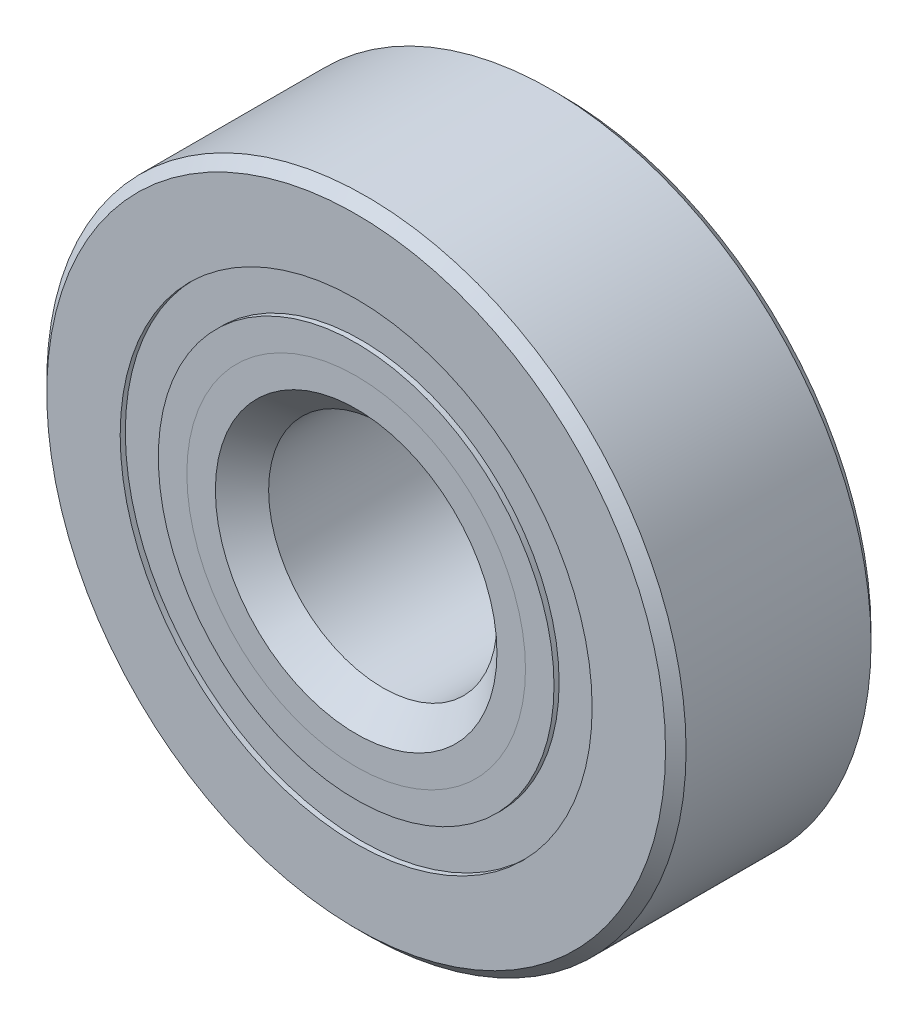
ISO-10303-21;
HEADER;
FILE_DESCRIPTION(('STEP AP214'),'2;1');
FILE_NAME('part.step','',(''),(''),'','','');
FILE_SCHEMA(('AUTOMOTIVE_DESIGN { 1 0 10303 214 1 1 1 1 }'));
ENDSEC;
DATA;
#1=APPLICATION_CONTEXT('core data for automotive mechanical design processes');
#2=APPLICATION_PROTOCOL_DEFINITION('international standard','automotive_design',2000,#1);
#3=PRODUCT_CONTEXT('',#1,'mechanical');
#4=PRODUCT('Part','Part','',(#3));
#5=PRODUCT_RELATED_PRODUCT_CATEGORY('part','',(#4));
#6=PRODUCT_DEFINITION_FORMATION('','',#4);
#7=PRODUCT_DEFINITION_CONTEXT('part definition',#1,'design');
#8=PRODUCT_DEFINITION('design','',#6,#7);
#9=PRODUCT_DEFINITION_SHAPE('','',#8);
#10=(LENGTH_UNIT() NAMED_UNIT(*) SI_UNIT(.MILLI.,.METRE.));
#11=(NAMED_UNIT(*) PLANE_ANGLE_UNIT() SI_UNIT($,.RADIAN.));
#12=(NAMED_UNIT(*) SI_UNIT($,.STERADIAN.) SOLID_ANGLE_UNIT());
#13=UNCERTAINTY_MEASURE_WITH_UNIT(LENGTH_MEASURE(1.E-05),#10,'distance_accuracy_value','');
#14=(GEOMETRIC_REPRESENTATION_CONTEXT(3) GLOBAL_UNCERTAINTY_ASSIGNED_CONTEXT((#13)) GLOBAL_UNIT_ASSIGNED_CONTEXT((#10,
#11,#12)) REPRESENTATION_CONTEXT('',''));
#15=CARTESIAN_POINT('',(0.,0.,0.));
#16=DIRECTION('',(0.,0.,1.));
#17=DIRECTION('',(1.,0.,0.));
#18=AXIS2_PLACEMENT_3D('',#15,#16,#17);
#19=CARTESIAN_POINT('',(0.,8.20353708791209,-3.39328125));
#20=DIRECTION('',(0.,0.,1.));
#21=DIRECTION('',(1.,0.,0.));
#22=AXIS2_PLACEMENT_3D('',#19,#20,#21);
#23=PLANE('',#22);
#24=CARTESIAN_POINT('',(0.,0.,-3.39328125));
#25=DIRECTION('',(0.,0.,1.));
#26=DIRECTION('',(1.,0.,0.));
#27=AXIS2_PLACEMENT_3D('',#24,#25,#26);
#28=CIRCLE('',#27,8.20353708791209);
#29=CARTESIAN_POINT('',(8.20353708791209,0.,-3.39328125));
#30=VERTEX_POINT('',#29);
#31=EDGE_CURVE('E57',#30,#30,#28,.T.);
#32=ORIENTED_EDGE('',*,*,#31,.F.);
#33=EDGE_LOOP('',(#32));
#34=FACE_BOUND('',#33,.T.);
#35=CARTESIAN_POINT('',(0.,0.,-3.39328125));
#36=DIRECTION('',(0.,0.,1.));
#37=DIRECTION('',(1.,0.,0.));
#38=AXIS2_PLACEMENT_3D('',#35,#36,#37);
#39=CIRCLE('',#38,6.87771291208791);
#40=CARTESIAN_POINT('',(6.87771291208791,0.,-3.39328125));
#41=VERTEX_POINT('',#40);
#42=EDGE_CURVE('E11',#41,#41,#39,.T.);
#43=ORIENTED_EDGE('',*,*,#42,.T.);
#44=EDGE_LOOP('',(#43));
#45=FACE_BOUND('',#44,.T.);
#46=ADVANCED_FACE('F43',(#34,#45),#23,.F.);
#47=CARTESIAN_POINT('',(0.,0.,3.571875));
#48=DIRECTION('',(0.,0.,1.));
#49=DIRECTION('',(1.,0.,0.));
#50=AXIS2_PLACEMENT_3D('',#47,#48,#49);
#51=CYLINDRICAL_SURFACE('',#50,6.87771291208791);
#52=ORIENTED_EDGE('',*,*,#42,.F.);
#53=EDGE_LOOP('',(#52));
#54=FACE_BOUND('',#53,.T.);
#55=CARTESIAN_POINT('',(0.,0.,-1.72035132641561));
#56=DIRECTION('',(0.,0.,1.));
#57=DIRECTION('',(1.,0.,0.));
#58=AXIS2_PLACEMENT_3D('',#55,#56,#57);
#59=CIRCLE('',#58,6.87771291208791);
#60=CARTESIAN_POINT('',(6.87771291208791,0.,-1.72035132641561));
#61=VERTEX_POINT('',#60);
#62=EDGE_CURVE('E49',#61,#61,#59,.T.);
#63=ORIENTED_EDGE('',*,*,#62,.T.);
#64=EDGE_LOOP('',(#63));
#65=FACE_BOUND('',#64,.T.);
#66=ADVANCED_FACE('F66',(#54,#65),#51,.F.);
#67=CARTESIAN_POINT('',(0.,8.20353708791209,-1.72035132641561));
#68=DIRECTION('',(0.,0.,-1.));
#69=DIRECTION('',(-1.,0.,0.));
#70=AXIS2_PLACEMENT_3D('',#67,#68,#69);
#71=PLANE('',#70);
#72=ORIENTED_EDGE('',*,*,#62,.F.);
#73=EDGE_LOOP('',(#72));
#74=FACE_BOUND('',#73,.T.);
#75=CARTESIAN_POINT('',(0.,0.,-1.72035132641561));
#76=DIRECTION('',(0.,0.,1.));
#77=DIRECTION('',(1.,0.,0.));
#78=AXIS2_PLACEMENT_3D('',#75,#76,#77);
#79=CIRCLE('',#78,8.20353708791209);
#80=CARTESIAN_POINT('',(8.20353708791209,0.,-1.72035132641561));
#81=VERTEX_POINT('',#80);
#82=EDGE_CURVE('E53',#81,#81,#79,.T.);
#83=ORIENTED_EDGE('',*,*,#82,.T.);
#84=EDGE_LOOP('',(#83));
#85=FACE_BOUND('',#84,.T.);
#86=ADVANCED_FACE('F70',(#74,#85),#71,.F.);
#87=CARTESIAN_POINT('',(0.,0.,3.571875));
#88=DIRECTION('',(0.,0.,1.));
#89=DIRECTION('',(1.,0.,0.));
#90=AXIS2_PLACEMENT_3D('',#87,#88,#89);
#91=CYLINDRICAL_SURFACE('',#90,8.20353708791209);
#92=ORIENTED_EDGE('',*,*,#82,.F.);
#93=EDGE_LOOP('',(#92));
#94=FACE_BOUND('',#93,.T.);
#95=ORIENTED_EDGE('',*,*,#31,.T.);
#96=EDGE_LOOP('',(#95));
#97=FACE_BOUND('',#96,.T.);
#98=ADVANCED_FACE('F63',(#94,#97),#91,.T.);
#99=CLOSED_SHELL('',(#46,#66,#86,#98));
#100=MANIFOLD_SOLID_BREP('B2',#99);
#101=CARTESIAN_POINT('',(0.,8.20353708791209,3.39328125));
#102=DIRECTION('',(0.,0.,-1.));
#103=DIRECTION('',(-1.,0.,0.));
#104=AXIS2_PLACEMENT_3D('',#101,#102,#103);
#105=PLANE('',#104);
#106=CARTESIAN_POINT('',(0.,0.,3.39328125));
#107=DIRECTION('',(0.,0.,1.));
#108=DIRECTION('',(1.,0.,0.));
#109=AXIS2_PLACEMENT_3D('',#106,#107,#108);
#110=CIRCLE('',#109,6.87771291208791);
#111=CARTESIAN_POINT('',(6.87771291208791,0.,3.39328125));
#112=VERTEX_POINT('',#111);
#113=EDGE_CURVE('E42',#112,#112,#110,.T.);
#114=ORIENTED_EDGE('',*,*,#113,.F.);
#115=EDGE_LOOP('',(#114));
#116=FACE_BOUND('',#115,.T.);
#117=CARTESIAN_POINT('',(0.,0.,3.39328125));
#118=DIRECTION('',(0.,0.,1.));
#119=DIRECTION('',(1.,0.,0.));
#120=AXIS2_PLACEMENT_3D('',#117,#118,#119);
#121=CIRCLE('',#120,8.20353708791209);
#122=CARTESIAN_POINT('',(8.20353708791209,0.,3.39328125));
#123=VERTEX_POINT('',#122);
#124=EDGE_CURVE('E124',#123,#123,#121,.T.);
#125=ORIENTED_EDGE('',*,*,#124,.T.);
#126=EDGE_LOOP('',(#125));
#127=FACE_BOUND('',#126,.T.);
#128=ADVANCED_FACE('F110',(#116,#127),#105,.F.);
#129=CARTESIAN_POINT('',(0.,0.,3.571875));
#130=DIRECTION('',(0.,0.,1.));
#131=DIRECTION('',(1.,0.,0.));
#132=AXIS2_PLACEMENT_3D('',#129,#130,#131);
#133=CYLINDRICAL_SURFACE('',#132,6.87771291208791);
#134=CARTESIAN_POINT('',(0.,0.,1.72035132641561));
#135=DIRECTION('',(0.,0.,1.));
#136=DIRECTION('',(1.,0.,0.));
#137=AXIS2_PLACEMENT_3D('',#134,#135,#136);
#138=CIRCLE('',#137,6.87771291208791);
#139=CARTESIAN_POINT('',(6.87771291208791,0.,1.72035132641561));
#140=VERTEX_POINT('',#139);
#141=EDGE_CURVE('E116',#140,#140,#138,.T.);
#142=ORIENTED_EDGE('',*,*,#141,.F.);
#143=EDGE_LOOP('',(#142));
#144=FACE_BOUND('',#143,.T.);
#145=ORIENTED_EDGE('',*,*,#113,.T.);
#146=EDGE_LOOP('',(#145));
#147=FACE_BOUND('',#146,.T.);
#148=ADVANCED_FACE('F139',(#144,#147),#133,.F.);
#149=CARTESIAN_POINT('',(0.,8.20353708791209,1.72035132641561));
#150=DIRECTION('',(0.,0.,1.));
#151=DIRECTION('',(1.,0.,0.));
#152=AXIS2_PLACEMENT_3D('',#149,#150,#151);
#153=PLANE('',#152);
#154=CARTESIAN_POINT('',(0.,0.,1.72035132641561));
#155=DIRECTION('',(0.,0.,1.));
#156=DIRECTION('',(1.,0.,0.));
#157=AXIS2_PLACEMENT_3D('',#154,#155,#156);
#158=CIRCLE('',#157,8.20353708791209);
#159=CARTESIAN_POINT('',(8.20353708791209,0.,1.72035132641561));
#160=VERTEX_POINT('',#159);
#161=EDGE_CURVE('E120',#160,#160,#158,.T.);
#162=ORIENTED_EDGE('',*,*,#161,.F.);
#163=EDGE_LOOP('',(#162));
#164=FACE_BOUND('',#163,.T.);
#165=ORIENTED_EDGE('',*,*,#141,.T.);
#166=EDGE_LOOP('',(#165));
#167=FACE_BOUND('',#166,.T.);
#168=ADVANCED_FACE('F134',(#164,#167),#153,.F.);
#169=CARTESIAN_POINT('',(0.,0.,3.571875));
#170=DIRECTION('',(0.,0.,1.));
#171=DIRECTION('',(1.,0.,0.));
#172=AXIS2_PLACEMENT_3D('',#169,#170,#171);
#173=CYLINDRICAL_SURFACE('',#172,8.20353708791209);
#174=ORIENTED_EDGE('',*,*,#124,.F.);
#175=EDGE_LOOP('',(#174));
#176=FACE_BOUND('',#175,.T.);
#177=ORIENTED_EDGE('',*,*,#161,.T.);
#178=EDGE_LOOP('',(#177));
#179=FACE_BOUND('',#178,.T.);
#180=ADVANCED_FACE('F131',(#176,#179),#173,.T.);
#181=CLOSED_SHELL('',(#128,#148,#168,#180));
#182=MANIFOLD_SOLID_BREP('B6',#181);
#183=CARTESIAN_POINT('',(-5.33202707188474,5.33202707188487,0.));
#184=DIRECTION('',(0.,0.,1.));
#185=DIRECTION('',(-0.707106781186539,0.707106781186556,0.));
#186=AXIS2_PLACEMENT_3D('',#183,#184,#185);
#187=SPHERICAL_SURFACE('',#186,1.72035132641561);
#188=CARTESIAN_POINT('',(-5.33202707188474,5.33202707188487,1.72035132641561));
#189=VERTEX_POINT('',#188);
#190=VERTEX_LOOP('',#189);
#191=FACE_BOUND('',#190,.T.);
#192=ADVANCED_FACE('F177',(#191),#187,.T.);
#193=CLOSED_SHELL('',(#192));
#194=MANIFOLD_SOLID_BREP('B37',#193);
#195=CARTESIAN_POINT('',(-7.540625,0.,0.));
#196=DIRECTION('',(0.,0.,1.));
#197=DIRECTION('',(-1.,0.,0.));
#198=AXIS2_PLACEMENT_3D('',#195,#196,#197);
#199=SPHERICAL_SURFACE('',#198,1.72035132641561);
#200=CARTESIAN_POINT('',(-7.540625,0.,1.72035132641561));
#201=VERTEX_POINT('',#200);
#202=VERTEX_LOOP('',#201);
#203=FACE_BOUND('',#202,.T.);
#204=ADVANCED_FACE('F210',(#203),#199,.T.);
#205=CLOSED_SHELL('',(#204));
#206=MANIFOLD_SOLID_BREP('B106',#205);
#207=CARTESIAN_POINT('',(-5.33202707188486,-5.33202707188476,0.));
#208=DIRECTION('',(0.,0.,1.));
#209=DIRECTION('',(-0.707106781186554,-0.707106781186541,0.));
#210=AXIS2_PLACEMENT_3D('',#207,#208,#209);
#211=SPHERICAL_SURFACE('',#210,1.72035132641561);
#212=CARTESIAN_POINT('',(-5.33202707188486,-5.33202707188476,1.72035132641561));
#213=VERTEX_POINT('',#212);
#214=VERTEX_LOOP('',#213);
#215=FACE_BOUND('',#214,.T.);
#216=ADVANCED_FACE('F243',(#215),#211,.T.);
#217=CLOSED_SHELL('',(#216));
#218=MANIFOLD_SOLID_BREP('B173',#217);
#219=CARTESIAN_POINT('',(0.,-7.540625,0.));
#220=DIRECTION('',(0.,0.,1.));
#221=DIRECTION('',(0.,-1.,0.));
#222=AXIS2_PLACEMENT_3D('',#219,#220,#221);
#223=SPHERICAL_SURFACE('',#222,1.72035132641561);
#224=CARTESIAN_POINT('',(0.,-7.540625,1.72035132641561));
#225=VERTEX_POINT('',#224);
#226=VERTEX_LOOP('',#225);
#227=FACE_BOUND('',#226,.T.);
#228=ADVANCED_FACE('F274',(#227),#223,.T.);
#229=CLOSED_SHELL('',(#228));
#230=MANIFOLD_SOLID_BREP('B206',#229);
#231=CARTESIAN_POINT('',(5.33202707188478,-5.33202707188484,0.));
#232=DIRECTION('',(0.,0.,1.));
#233=DIRECTION('',(0.707106781186544,-0.707106781186551,0.));
#234=AXIS2_PLACEMENT_3D('',#231,#232,#233);
#235=SPHERICAL_SURFACE('',#234,1.72035132641561);
#236=CARTESIAN_POINT('',(5.33202707188478,-5.33202707188484,1.72035132641561));
#237=VERTEX_POINT('',#236);
#238=VERTEX_LOOP('',#237);
#239=FACE_BOUND('',#238,.T.);
#240=ADVANCED_FACE('F307',(#239),#235,.T.);
#241=CLOSED_SHELL('',(#240));
#242=MANIFOLD_SOLID_BREP('B239',#241);
#243=CARTESIAN_POINT('',(7.540625,0.,0.));
#244=DIRECTION('',(0.,0.,1.));
#245=DIRECTION('',(1.,0.,0.));
#246=AXIS2_PLACEMENT_3D('',#243,#244,#245);
#247=SPHERICAL_SURFACE('',#246,1.72035132641561);
#248=CARTESIAN_POINT('',(7.540625,0.,1.72035132641561));
#249=VERTEX_POINT('',#248);
#250=VERTEX_LOOP('',#249);
#251=FACE_BOUND('',#250,.T.);
#252=ADVANCED_FACE('F338',(#251),#247,.T.);
#253=CLOSED_SHELL('',(#252));
#254=MANIFOLD_SOLID_BREP('B270',#253);
#255=CARTESIAN_POINT('',(5.33202707188482,5.3320270718848,0.));
#256=DIRECTION('',(0.,0.,1.));
#257=DIRECTION('',(0.707106781186549,0.707106781186546,0.));
#258=AXIS2_PLACEMENT_3D('',#255,#256,#257);
#259=SPHERICAL_SURFACE('',#258,1.72035132641561);
#260=CARTESIAN_POINT('',(5.33202707188482,5.3320270718848,1.72035132641561));
#261=VERTEX_POINT('',#260);
#262=VERTEX_LOOP('',#261);
#263=FACE_BOUND('',#262,.T.);
#264=ADVANCED_FACE('F369',(#263),#259,.T.);
#265=CLOSED_SHELL('',(#264));
#266=MANIFOLD_SOLID_BREP('B303',#265);
#267=CARTESIAN_POINT('',(0.,7.540625,0.));
#268=DIRECTION('',(0.,0.,1.));
#269=DIRECTION('',(0.,1.,0.));
#270=AXIS2_PLACEMENT_3D('',#267,#268,#269);
#271=SPHERICAL_SURFACE('',#270,1.72035132641561);
#272=CARTESIAN_POINT('',(0.,7.540625,1.72035132641561));
#273=VERTEX_POINT('',#272);
#274=VERTEX_LOOP('',#273);
#275=FACE_BOUND('',#274,.T.);
#276=ADVANCED_FACE('F404',(#275),#271,.T.);
#277=CLOSED_SHELL('',(#276));
#278=MANIFOLD_SOLID_BREP('B334',#277);
#279=CARTESIAN_POINT('',(0.,5.88611237444005,3.571875));
#280=DIRECTION('',(0.,0.,-1.));
#281=DIRECTION('',(-1.,0.,0.));
#282=AXIS2_PLACEMENT_3D('',#279,#280,#281);
#283=PLANE('',#282);
#284=CARTESIAN_POINT('',(0.,0.,3.571875));
#285=DIRECTION('',(0.,0.,1.));
#286=DIRECTION('',(1.,0.,0.));
#287=AXIS2_PLACEMENT_3D('',#284,#285,#286);
#288=CIRCLE('',#287,4.89451183679219);
#289=CARTESIAN_POINT('',(4.89451183679219,0.,3.571875));
#290=VERTEX_POINT('',#289);
#291=EDGE_CURVE('E458',#290,#290,#288,.T.);
#292=ORIENTED_EDGE('',*,*,#291,.F.);
#293=EDGE_LOOP('',(#292));
#294=FACE_BOUND('',#293,.T.);
#295=CARTESIAN_POINT('',(0.,0.,3.571875));
#296=DIRECTION('',(0.,0.,1.));
#297=DIRECTION('',(1.,0.,0.));
#298=AXIS2_PLACEMENT_3D('',#295,#296,#297);
#299=CIRCLE('',#298,5.88611237444005);
#300=CARTESIAN_POINT('',(5.88611237444005,0.,3.571875));
#301=VERTEX_POINT('',#300);
#302=EDGE_CURVE('E403',#301,#301,#299,.T.);
#303=ORIENTED_EDGE('',*,*,#302,.T.);
#304=EDGE_LOOP('',(#303));
#305=FACE_BOUND('',#304,.T.);
#306=ADVANCED_FACE('F424',(#294,#305),#283,.F.);
#307=CARTESIAN_POINT('',(0.,0.,2.58027446235215));
#308=DIRECTION('',(0.,0.,1.));
#309=DIRECTION('',(1.,0.,0.));
#310=AXIS2_PLACEMENT_3D('',#307,#308,#309);
#311=CONICAL_SURFACE('',#310,4.89451183679219,0.78539816339745);
#312=ORIENTED_EDGE('',*,*,#302,.F.);
#313=EDGE_LOOP('',(#312));
#314=FACE_BOUND('',#313,.T.);
#315=CARTESIAN_POINT('',(0.,0.,2.58027446235215));
#316=DIRECTION('',(0.,0.,1.));
#317=DIRECTION('',(1.,0.,0.));
#318=AXIS2_PLACEMENT_3D('',#315,#316,#317);
#319=CIRCLE('',#318,4.89451183679219);
#320=CARTESIAN_POINT('',(4.89451183679219,0.,2.58027446235215));
#321=VERTEX_POINT('',#320);
#322=EDGE_CURVE('E430',#321,#321,#319,.T.);
#323=ORIENTED_EDGE('',*,*,#322,.T.);
#324=EDGE_LOOP('',(#323));
#325=FACE_BOUND('',#324,.T.);
#326=ADVANCED_FACE('F465',(#314,#325),#311,.T.);
#327=CARTESIAN_POINT('',(0.,0.,3.571875));
#328=DIRECTION('',(0.,0.,1.));
#329=DIRECTION('',(1.,0.,0.));
#330=AXIS2_PLACEMENT_3D('',#327,#328,#329);
#331=CYLINDRICAL_SURFACE('',#330,4.89451183679219);
#332=ORIENTED_EDGE('',*,*,#322,.F.);
#333=EDGE_LOOP('',(#332));
#334=FACE_BOUND('',#333,.T.);
#335=CARTESIAN_POINT('',(0.,0.,0.));
#336=DIRECTION('',(0.,0.,1.));
#337=DIRECTION('',(1.,0.,0.));
#338=AXIS2_PLACEMENT_3D('',#335,#336,#337);
#339=CIRCLE('',#338,4.89451183679219);
#340=CARTESIAN_POINT('',(4.89451183679219,0.,0.));
#341=VERTEX_POINT('',#340);
#342=EDGE_CURVE('E434',#341,#341,#339,.T.);
#343=ORIENTED_EDGE('',*,*,#342,.T.);
#344=EDGE_LOOP('',(#343));
#345=FACE_BOUND('',#344,.T.);
#346=ADVANCED_FACE('F469',(#334,#345),#331,.T.);
#347=CARTESIAN_POINT('',(0.,4.89451183679219,0.));
#348=DIRECTION('',(0.,0.,-1.));
#349=DIRECTION('',(-1.,0.,0.));
#350=AXIS2_PLACEMENT_3D('',#347,#348,#349);
#351=PLANE('',#350);
#352=ORIENTED_EDGE('',*,*,#342,.F.);
#353=EDGE_LOOP('',(#352));
#354=FACE_BOUND('',#353,.T.);
#355=CARTESIAN_POINT('',(0.,0.,0.));
#356=DIRECTION('',(0.,0.,1.));
#357=DIRECTION('',(1.,0.,0.));
#358=AXIS2_PLACEMENT_3D('',#355,#356,#357);
#359=CIRCLE('',#358,5.82027367358438);
#360=CARTESIAN_POINT('',(5.82027367358438,0.,0.));
#361=VERTEX_POINT('',#360);
#362=EDGE_CURVE('E438',#361,#361,#359,.T.);
#363=ORIENTED_EDGE('',*,*,#362,.T.);
#364=EDGE_LOOP('',(#363));
#365=FACE_BOUND('',#364,.T.);
#366=ADVANCED_FACE('F474',(#354,#365),#351,.F.);
#367=CARTESIAN_POINT('',(0.,0.,0.));
#368=DIRECTION('',(0.,0.,1.));
#369=DIRECTION('',(1.,0.,0.));
#370=AXIS2_PLACEMENT_3D('',#367,#368,#369);
#371=TOROIDAL_SURFACE('',#370,7.540625,1.72035132641561);
#372=ORIENTED_EDGE('',*,*,#362,.F.);
#373=EDGE_LOOP('',(#372));
#374=FACE_BOUND('',#373,.T.);
#375=CARTESIAN_POINT('',(0.,0.,-1.5875));
#376=DIRECTION('',(0.,0.,1.));
#377=DIRECTION('',(1.,0.,0.));
#378=AXIS2_PLACEMENT_3D('',#375,#376,#377);
#379=CIRCLE('',#378,6.87771291208791);
#380=CARTESIAN_POINT('',(6.87771291208791,0.,-1.5875));
#381=VERTEX_POINT('',#380);
#382=EDGE_CURVE('E443',#381,#381,#379,.T.);
#383=ORIENTED_EDGE('',*,*,#382,.T.);
#384=EDGE_LOOP('',(#383));
#385=FACE_BOUND('',#384,.T.);
#386=ADVANCED_FACE('F480',(#374,#385),#371,.F.);
#387=CARTESIAN_POINT('',(0.,0.,3.571875));
#388=DIRECTION('',(0.,0.,1.));
#389=DIRECTION('',(1.,0.,0.));
#390=AXIS2_PLACEMENT_3D('',#387,#388,#389);
#391=CYLINDRICAL_SURFACE('',#390,6.87771291208791);
#392=ORIENTED_EDGE('',*,*,#382,.F.);
#393=EDGE_LOOP('',(#392));
#394=FACE_BOUND('',#393,.T.);
#395=CARTESIAN_POINT('',(0.,0.,-3.571875));
#396=DIRECTION('',(0.,0.,1.));
#397=DIRECTION('',(1.,0.,0.));
#398=AXIS2_PLACEMENT_3D('',#395,#396,#397);
#399=CIRCLE('',#398,6.87771291208791);
#400=CARTESIAN_POINT('',(6.87771291208791,0.,-3.571875));
#401=VERTEX_POINT('',#400);
#402=EDGE_CURVE('E446',#401,#401,#399,.T.);
#403=ORIENTED_EDGE('',*,*,#402,.T.);
#404=EDGE_LOOP('',(#403));
#405=FACE_BOUND('',#404,.T.);
#406=ADVANCED_FACE('F484',(#394,#405),#391,.T.);
#407=CARTESIAN_POINT('',(0.,4.3259375,-3.571875));
#408=DIRECTION('',(0.,0.,1.));
#409=DIRECTION('',(1.,0.,0.));
#410=AXIS2_PLACEMENT_3D('',#407,#408,#409);
#411=PLANE('',#410);
#412=ORIENTED_EDGE('',*,*,#402,.F.);
#413=EDGE_LOOP('',(#412));
#414=FACE_BOUND('',#413,.T.);
#415=CARTESIAN_POINT('',(0.,0.,-3.571875));
#416=DIRECTION('',(0.,0.,1.));
#417=DIRECTION('',(1.,0.,0.));
#418=AXIS2_PLACEMENT_3D('',#415,#416,#417);
#419=CIRCLE('',#418,4.3259375);
#420=CARTESIAN_POINT('',(4.3259375,0.,-3.571875));
#421=VERTEX_POINT('',#420);
#422=EDGE_CURVE('E449',#421,#421,#419,.T.);
#423=ORIENTED_EDGE('',*,*,#422,.T.);
#424=EDGE_LOOP('',(#423));
#425=FACE_BOUND('',#424,.T.);
#426=ADVANCED_FACE('F488',(#414,#425),#411,.F.);
#427=CARTESIAN_POINT('',(0.,0.,-3.2146875));
#428=DIRECTION('',(0.,0.,-1.));
#429=DIRECTION('',(-1.,0.,0.));
#430=AXIS2_PLACEMENT_3D('',#427,#428,#429);
#431=CONICAL_SURFACE('',#430,3.96875,0.785398163397447);
#432=ORIENTED_EDGE('',*,*,#422,.F.);
#433=EDGE_LOOP('',(#432));
#434=FACE_BOUND('',#433,.T.);
#435=CARTESIAN_POINT('',(0.,0.,-3.2146875));
#436=DIRECTION('',(0.,0.,1.));
#437=DIRECTION('',(1.,0.,0.));
#438=AXIS2_PLACEMENT_3D('',#435,#436,#437);
#439=CIRCLE('',#438,3.96875);
#440=CARTESIAN_POINT('',(3.96875,0.,-3.2146875));
#441=VERTEX_POINT('',#440);
#442=EDGE_CURVE('E452',#441,#441,#439,.T.);
#443=ORIENTED_EDGE('',*,*,#442,.T.);
#444=EDGE_LOOP('',(#443));
#445=FACE_BOUND('',#444,.T.);
#446=ADVANCED_FACE('F492',(#434,#445),#431,.F.);
#447=CARTESIAN_POINT('',(0.,0.,3.571875));
#448=DIRECTION('',(0.,0.,1.));
#449=DIRECTION('',(1.,0.,0.));
#450=AXIS2_PLACEMENT_3D('',#447,#448,#449);
#451=CYLINDRICAL_SURFACE('',#450,3.96875);
#452=ORIENTED_EDGE('',*,*,#442,.F.);
#453=EDGE_LOOP('',(#452));
#454=FACE_BOUND('',#453,.T.);
#455=CARTESIAN_POINT('',(0.,0.,2.64611316320781));
#456=DIRECTION('',(0.,0.,1.));
#457=DIRECTION('',(1.,0.,0.));
#458=AXIS2_PLACEMENT_3D('',#455,#456,#457);
#459=CIRCLE('',#458,3.96875);
#460=CARTESIAN_POINT('',(3.96875,0.,2.64611316320781));
#461=VERTEX_POINT('',#460);
#462=EDGE_CURVE('E455',#461,#461,#459,.T.);
#463=ORIENTED_EDGE('',*,*,#462,.T.);
#464=EDGE_LOOP('',(#463));
#465=FACE_BOUND('',#464,.T.);
#466=ADVANCED_FACE('F496',(#454,#465),#451,.F.);
#467=CARTESIAN_POINT('',(0.,0.,3.571875));
#468=DIRECTION('',(0.,0.,1.));
#469=DIRECTION('',(1.,0.,0.));
#470=AXIS2_PLACEMENT_3D('',#467,#468,#469);
#471=CONICAL_SURFACE('',#470,4.89451183679219,0.78539816339745);
#472=ORIENTED_EDGE('',*,*,#462,.F.);
#473=EDGE_LOOP('',(#472));
#474=FACE_BOUND('',#473,.T.);
#475=ORIENTED_EDGE('',*,*,#291,.T.);
#476=EDGE_LOOP('',(#475));
#477=FACE_BOUND('',#476,.T.);
#478=ADVANCED_FACE('F462',(#474,#477),#471,.F.);
#479=CLOSED_SHELL('',(#306,#326,#346,#366,#386,#406,#426,#446,#466,#478));
#480=MANIFOLD_SOLID_BREP('B365',#479);
#481=CARTESIAN_POINT('',(0.,6.87771291208791,3.571875));
#482=DIRECTION('',(0.,0.,-1.));
#483=DIRECTION('',(-1.,0.,0.));
#484=AXIS2_PLACEMENT_3D('',#481,#482,#483);
#485=PLANE('',#484);
#486=CARTESIAN_POINT('',(0.,0.,3.571875));
#487=DIRECTION('',(0.,0.,1.));
#488=DIRECTION('',(1.,0.,0.));
#489=AXIS2_PLACEMENT_3D('',#486,#487,#488);
#490=CIRCLE('',#489,5.88611237444005);
#491=CARTESIAN_POINT('',(5.88611237444005,0.,3.571875));
#492=VERTEX_POINT('',#491);
#493=EDGE_CURVE('E423',#492,#492,#490,.T.);
#494=ORIENTED_EDGE('',*,*,#493,.F.);
#495=EDGE_LOOP('',(#494));
#496=FACE_BOUND('',#495,.T.);
#497=CARTESIAN_POINT('',(0.,0.,3.571875));
#498=DIRECTION('',(0.,0.,1.));
#499=DIRECTION('',(1.,0.,0.));
#500=AXIS2_PLACEMENT_3D('',#497,#498,#499);
#501=CIRCLE('',#500,6.87771291208791);
#502=CARTESIAN_POINT('',(6.87771291208791,0.,3.571875));
#503=VERTEX_POINT('',#502);
#504=EDGE_CURVE('E604',#503,#503,#501,.T.);
#505=ORIENTED_EDGE('',*,*,#504,.T.);
#506=EDGE_LOOP('',(#505));
#507=FACE_BOUND('',#506,.T.);
#508=ADVANCED_FACE('F582',(#496,#507),#485,.F.);
#509=CARTESIAN_POINT('',(0.,0.,3.571875));
#510=DIRECTION('',(0.,0.,1.));
#511=DIRECTION('',(1.,0.,0.));
#512=AXIS2_PLACEMENT_3D('',#509,#510,#511);
#513=CONICAL_SURFACE('',#512,5.88611237444005,0.78539816339745);
#514=CARTESIAN_POINT('',(0.,0.,2.58027446235215));
#515=DIRECTION('',(0.,0.,1.));
#516=DIRECTION('',(1.,0.,0.));
#517=AXIS2_PLACEMENT_3D('',#514,#515,#516);
#518=CIRCLE('',#517,4.89451183679219);
#519=CARTESIAN_POINT('',(4.89451183679219,0.,2.58027446235215));
#520=VERTEX_POINT('',#519);
#521=EDGE_CURVE('E588',#520,#520,#518,.T.);
#522=ORIENTED_EDGE('',*,*,#521,.F.);
#523=EDGE_LOOP('',(#522));
#524=FACE_BOUND('',#523,.T.);
#525=ORIENTED_EDGE('',*,*,#493,.T.);
#526=EDGE_LOOP('',(#525));
#527=FACE_BOUND('',#526,.T.);
#528=ADVANCED_FACE('F629',(#524,#527),#513,.F.);
#529=CARTESIAN_POINT('',(0.,0.,3.571875));
#530=DIRECTION('',(0.,0.,1.));
#531=DIRECTION('',(1.,0.,0.));
#532=AXIS2_PLACEMENT_3D('',#529,#530,#531);
#533=CYLINDRICAL_SURFACE('',#532,4.89451183679219);
#534=CARTESIAN_POINT('',(0.,0.,0.));
#535=DIRECTION('',(0.,0.,1.));
#536=DIRECTION('',(1.,0.,0.));
#537=AXIS2_PLACEMENT_3D('',#534,#535,#536);
#538=CIRCLE('',#537,4.89451183679219);
#539=CARTESIAN_POINT('',(4.89451183679219,0.,0.));
#540=VERTEX_POINT('',#539);
#541=EDGE_CURVE('E592',#540,#540,#538,.T.);
#542=ORIENTED_EDGE('',*,*,#541,.F.);
#543=EDGE_LOOP('',(#542));
#544=FACE_BOUND('',#543,.T.);
#545=ORIENTED_EDGE('',*,*,#521,.T.);
#546=EDGE_LOOP('',(#545));
#547=FACE_BOUND('',#546,.T.);
#548=ADVANCED_FACE('F624',(#544,#547),#533,.F.);
#549=CARTESIAN_POINT('',(0.,4.89451183679219,0.));
#550=DIRECTION('',(0.,0.,1.));
#551=DIRECTION('',(1.,0.,0.));
#552=AXIS2_PLACEMENT_3D('',#549,#550,#551);
#553=PLANE('',#552);
#554=CARTESIAN_POINT('',(0.,0.,0.));
#555=DIRECTION('',(0.,0.,1.));
#556=DIRECTION('',(1.,0.,0.));
#557=AXIS2_PLACEMENT_3D('',#554,#555,#556);
#558=CIRCLE('',#557,5.82027367358438);
#559=CARTESIAN_POINT('',(5.82027367358438,0.,0.));
#560=VERTEX_POINT('',#559);
#561=EDGE_CURVE('E596',#560,#560,#558,.T.);
#562=ORIENTED_EDGE('',*,*,#561,.F.);
#563=EDGE_LOOP('',(#562));
#564=FACE_BOUND('',#563,.T.);
#565=ORIENTED_EDGE('',*,*,#541,.T.);
#566=EDGE_LOOP('',(#565));
#567=FACE_BOUND('',#566,.T.);
#568=ADVANCED_FACE('F618',(#564,#567),#553,.F.);
#569=CARTESIAN_POINT('',(0.,0.,0.));
#570=DIRECTION('',(0.,0.,1.));
#571=DIRECTION('',(1.,0.,0.));
#572=AXIS2_PLACEMENT_3D('',#569,#570,#571);
#573=TOROIDAL_SURFACE('',#572,7.540625,1.72035132641561);
#574=CARTESIAN_POINT('',(0.,0.,1.5875));
#575=DIRECTION('',(0.,0.,1.));
#576=DIRECTION('',(1.,0.,0.));
#577=AXIS2_PLACEMENT_3D('',#574,#575,#576);
#578=CIRCLE('',#577,6.87771291208791);
#579=CARTESIAN_POINT('',(6.87771291208791,0.,1.5875));
#580=VERTEX_POINT('',#579);
#581=EDGE_CURVE('E601',#580,#580,#578,.T.);
#582=ORIENTED_EDGE('',*,*,#581,.F.);
#583=EDGE_LOOP('',(#582));
#584=FACE_BOUND('',#583,.T.);
#585=ORIENTED_EDGE('',*,*,#561,.T.);
#586=EDGE_LOOP('',(#585));
#587=FACE_BOUND('',#586,.T.);
#588=ADVANCED_FACE('F612',(#584,#587),#573,.F.);
#589=CARTESIAN_POINT('',(0.,0.,3.571875));
#590=DIRECTION('',(0.,0.,1.));
#591=DIRECTION('',(1.,0.,0.));
#592=AXIS2_PLACEMENT_3D('',#589,#590,#591);
#593=CYLINDRICAL_SURFACE('',#592,6.87771291208791);
#594=ORIENTED_EDGE('',*,*,#504,.F.);
#595=EDGE_LOOP('',(#594));
#596=FACE_BOUND('',#595,.T.);
#597=ORIENTED_EDGE('',*,*,#581,.T.);
#598=EDGE_LOOP('',(#597));
#599=FACE_BOUND('',#598,.T.);
#600=ADVANCED_FACE('F609',(#596,#599),#593,.T.);
#601=CLOSED_SHELL('',(#508,#528,#548,#568,#588,#600));
#602=MANIFOLD_SOLID_BREP('B398',#601);
#603=CARTESIAN_POINT('',(0.,0.,3.2146875));
#604=DIRECTION('',(0.,0.,-1.));
#605=DIRECTION('',(-1.,0.,0.));
#606=AXIS2_PLACEMENT_3D('',#603,#604,#605);
#607=CONICAL_SURFACE('',#606,11.1125,0.785398163397446);
#608=CARTESIAN_POINT('',(0.,0.,3.571875));
#609=DIRECTION('',(0.,0.,1.));
#610=DIRECTION('',(1.,0.,0.));
#611=AXIS2_PLACEMENT_3D('',#608,#609,#610);
#612=CIRCLE('',#611,10.7553125);
#613=CARTESIAN_POINT('',(10.7553125,0.,3.571875));
#614=VERTEX_POINT('',#613);
#615=EDGE_CURVE('E701',#614,#614,#612,.T.);
#616=ORIENTED_EDGE('',*,*,#615,.F.);
#617=EDGE_LOOP('',(#616));
#618=FACE_BOUND('',#617,.T.);
#619=CARTESIAN_POINT('',(0.,0.,3.2146875));
#620=DIRECTION('',(0.,0.,1.));
#621=DIRECTION('',(1.,0.,0.));
#622=AXIS2_PLACEMENT_3D('',#619,#620,#621);
#623=CIRCLE('',#622,11.1125);
#624=CARTESIAN_POINT('',(11.1125,0.,3.2146875));
#625=VERTEX_POINT('',#624);
#626=EDGE_CURVE('E581',#625,#625,#623,.T.);
#627=ORIENTED_EDGE('',*,*,#626,.T.);
#628=EDGE_LOOP('',(#627));
#629=FACE_BOUND('',#628,.T.);
#630=ADVANCED_FACE('F673',(#618,#629),#607,.T.);
#631=CARTESIAN_POINT('',(0.,0.,3.571875));
#632=DIRECTION('',(0.,0.,1.));
#633=DIRECTION('',(1.,0.,0.));
#634=AXIS2_PLACEMENT_3D('',#631,#632,#633);
#635=CYLINDRICAL_SURFACE('',#634,11.1125);
#636=ORIENTED_EDGE('',*,*,#626,.F.);
#637=EDGE_LOOP('',(#636));
#638=FACE_BOUND('',#637,.T.);
#639=CARTESIAN_POINT('',(0.,0.,-3.2146875));
#640=DIRECTION('',(0.,0.,1.));
#641=DIRECTION('',(1.,0.,0.));
#642=AXIS2_PLACEMENT_3D('',#639,#640,#641);
#643=CIRCLE('',#642,11.1125);
#644=CARTESIAN_POINT('',(11.1125,0.,-3.2146875));
#645=VERTEX_POINT('',#644);
#646=EDGE_CURVE('E679',#645,#645,#643,.T.);
#647=ORIENTED_EDGE('',*,*,#646,.T.);
#648=EDGE_LOOP('',(#647));
#649=FACE_BOUND('',#648,.T.);
#650=ADVANCED_FACE('F708',(#638,#649),#635,.T.);
#651=CARTESIAN_POINT('',(0.,0.,-3.571875));
#652=DIRECTION('',(0.,0.,1.));
#653=DIRECTION('',(1.,0.,0.));
#654=AXIS2_PLACEMENT_3D('',#651,#652,#653);
#655=CONICAL_SURFACE('',#654,10.7553125,0.785398163397444);
#656=ORIENTED_EDGE('',*,*,#646,.F.);
#657=EDGE_LOOP('',(#656));
#658=FACE_BOUND('',#657,.T.);
#659=CARTESIAN_POINT('',(0.,0.,-3.571875));
#660=DIRECTION('',(0.,0.,1.));
#661=DIRECTION('',(1.,0.,0.));
#662=AXIS2_PLACEMENT_3D('',#659,#660,#661);
#663=CIRCLE('',#662,10.7553125);
#664=CARTESIAN_POINT('',(10.7553125,0.,-3.571875));
#665=VERTEX_POINT('',#664);
#666=EDGE_CURVE('E683',#665,#665,#663,.T.);
#667=ORIENTED_EDGE('',*,*,#666,.T.);
#668=EDGE_LOOP('',(#667));
#669=FACE_BOUND('',#668,.T.);
#670=ADVANCED_FACE('F712',(#658,#669),#655,.T.);
#671=CARTESIAN_POINT('',(0.,10.7553125,-3.571875));
#672=DIRECTION('',(0.,0.,1.));
#673=DIRECTION('',(1.,0.,0.));
#674=AXIS2_PLACEMENT_3D('',#671,#672,#673);
#675=PLANE('',#674);
#676=ORIENTED_EDGE('',*,*,#666,.F.);
#677=EDGE_LOOP('',(#676));
#678=FACE_BOUND('',#677,.T.);
#679=CARTESIAN_POINT('',(0.,0.,-3.571875));
#680=DIRECTION('',(0.,0.,1.));
#681=DIRECTION('',(1.,0.,0.));
#682=AXIS2_PLACEMENT_3D('',#679,#680,#681);
#683=CIRCLE('',#682,8.20353708791209);
#684=CARTESIAN_POINT('',(8.20353708791209,0.,-3.571875));
#685=VERTEX_POINT('',#684);
#686=EDGE_CURVE('E687',#685,#685,#683,.T.);
#687=ORIENTED_EDGE('',*,*,#686,.T.);
#688=EDGE_LOOP('',(#687));
#689=FACE_BOUND('',#688,.T.);
#690=ADVANCED_FACE('F717',(#678,#689),#675,.F.);
#691=CARTESIAN_POINT('',(0.,0.,3.571875));
#692=DIRECTION('',(0.,0.,1.));
#693=DIRECTION('',(1.,0.,0.));
#694=AXIS2_PLACEMENT_3D('',#691,#692,#693);
#695=CYLINDRICAL_SURFACE('',#694,8.20353708791209);
#696=ORIENTED_EDGE('',*,*,#686,.F.);
#697=EDGE_LOOP('',(#696));
#698=FACE_BOUND('',#697,.T.);
#699=CARTESIAN_POINT('',(0.,0.,-1.5875));
#700=DIRECTION('',(0.,0.,1.));
#701=DIRECTION('',(1.,0.,0.));
#702=AXIS2_PLACEMENT_3D('',#699,#700,#701);
#703=CIRCLE('',#702,8.20353708791209);
#704=CARTESIAN_POINT('',(8.20353708791209,0.,-1.5875));
#705=VERTEX_POINT('',#704);
#706=EDGE_CURVE('E692',#705,#705,#703,.T.);
#707=ORIENTED_EDGE('',*,*,#706,.T.);
#708=EDGE_LOOP('',(#707));
#709=FACE_BOUND('',#708,.T.);
#710=ADVANCED_FACE('F723',(#698,#709),#695,.F.);
#711=CARTESIAN_POINT('',(0.,0.,0.));
#712=DIRECTION('',(0.,0.,1.));
#713=DIRECTION('',(1.,0.,0.));
#714=AXIS2_PLACEMENT_3D('',#711,#712,#713);
#715=TOROIDAL_SURFACE('',#714,7.540625,1.72035132641561);
#716=ORIENTED_EDGE('',*,*,#706,.F.);
#717=EDGE_LOOP('',(#716));
#718=FACE_BOUND('',#717,.T.);
#719=CARTESIAN_POINT('',(0.,0.,1.5875));
#720=DIRECTION('',(0.,0.,1.));
#721=DIRECTION('',(1.,0.,0.));
#722=AXIS2_PLACEMENT_3D('',#719,#720,#721);
#723=CIRCLE('',#722,8.20353708791209);
#724=CARTESIAN_POINT('',(8.20353708791209,0.,1.5875));
#725=VERTEX_POINT('',#724);
#726=EDGE_CURVE('E695',#725,#725,#723,.T.);
#727=ORIENTED_EDGE('',*,*,#726,.T.);
#728=EDGE_LOOP('',(#727));
#729=FACE_BOUND('',#728,.T.);
#730=ADVANCED_FACE('F727',(#718,#729),#715,.F.);
#731=CARTESIAN_POINT('',(0.,0.,3.571875));
#732=DIRECTION('',(0.,0.,1.));
#733=DIRECTION('',(1.,0.,0.));
#734=AXIS2_PLACEMENT_3D('',#731,#732,#733);
#735=CYLINDRICAL_SURFACE('',#734,8.20353708791209);
#736=ORIENTED_EDGE('',*,*,#726,.F.);
#737=EDGE_LOOP('',(#736));
#738=FACE_BOUND('',#737,.T.);
#739=CARTESIAN_POINT('',(0.,0.,3.571875));
#740=DIRECTION('',(0.,0.,1.));
#741=DIRECTION('',(1.,0.,0.));
#742=AXIS2_PLACEMENT_3D('',#739,#740,#741);
#743=CIRCLE('',#742,8.20353708791209);
#744=CARTESIAN_POINT('',(8.20353708791209,0.,3.571875));
#745=VERTEX_POINT('',#744);
#746=EDGE_CURVE('E698',#745,#745,#743,.T.);
#747=ORIENTED_EDGE('',*,*,#746,.T.);
#748=EDGE_LOOP('',(#747));
#749=FACE_BOUND('',#748,.T.);
#750=ADVANCED_FACE('F731',(#738,#749),#735,.F.);
#751=CARTESIAN_POINT('',(0.,10.7553125,3.571875));
#752=DIRECTION('',(0.,0.,-1.));
#753=DIRECTION('',(-1.,0.,0.));
#754=AXIS2_PLACEMENT_3D('',#751,#752,#753);
#755=PLANE('',#754);
#756=ORIENTED_EDGE('',*,*,#746,.F.);
#757=EDGE_LOOP('',(#756));
#758=FACE_BOUND('',#757,.T.);
#759=ORIENTED_EDGE('',*,*,#615,.T.);
#760=EDGE_LOOP('',(#759));
#761=FACE_BOUND('',#760,.T.);
#762=ADVANCED_FACE('F705',(#758,#761),#755,.F.);
#763=CLOSED_SHELL('',(#630,#650,#670,#690,#710,#730,#750,#762));
#764=MANIFOLD_SOLID_BREP('B418',#763);
#765=ADVANCED_BREP_SHAPE_REPRESENTATION('',(#18,#100,#182,#194,#206,#218,#230,#242,#254,#266,
#278,#480,#602,#764),#14);
#766=SHAPE_DEFINITION_REPRESENTATION(#9,#765);
ENDSEC;
END-ISO-10303-21;
